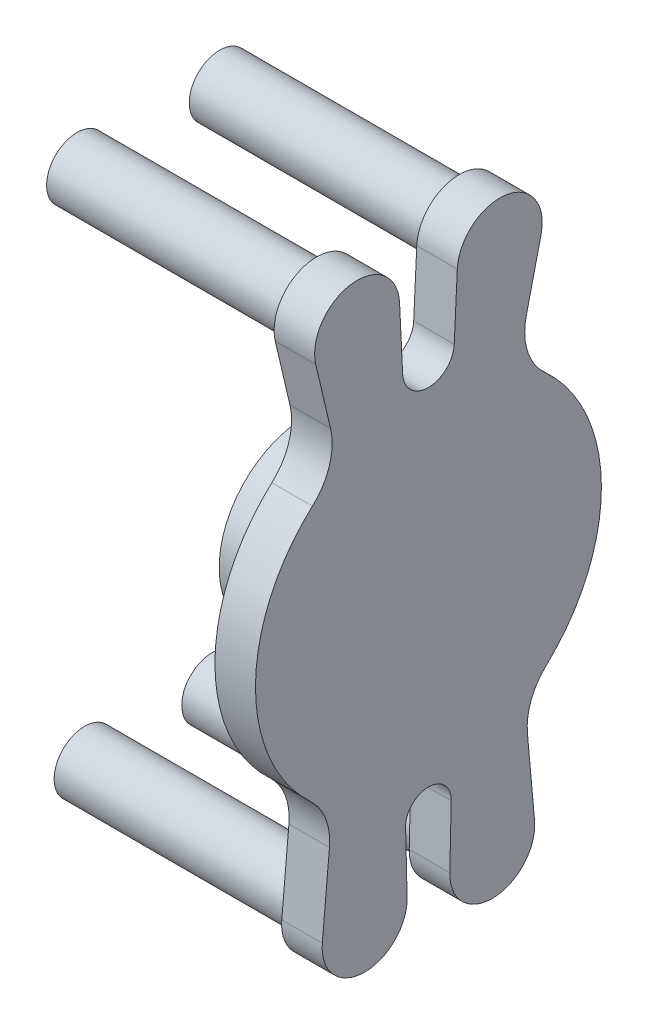
ISO-10303-21;
HEADER;
FILE_DESCRIPTION(('STEP AP214'),'2;1');
FILE_NAME('part.step','',(''),(''),'','','');
FILE_SCHEMA(('AUTOMOTIVE_DESIGN { 1 0 10303 214 1 1 1 1 }'));
ENDSEC;
DATA;
#1=APPLICATION_CONTEXT('core data for automotive mechanical design processes');
#2=APPLICATION_PROTOCOL_DEFINITION('international standard','automotive_design',2000,#1);
#3=PRODUCT_CONTEXT('',#1,'mechanical');
#4=PRODUCT('Part','Part','',(#3));
#5=PRODUCT_RELATED_PRODUCT_CATEGORY('part','',(#4));
#6=PRODUCT_DEFINITION_FORMATION('','',#4);
#7=PRODUCT_DEFINITION_CONTEXT('part definition',#1,'design');
#8=PRODUCT_DEFINITION('design','',#6,#7);
#9=PRODUCT_DEFINITION_SHAPE('','',#8);
#10=(LENGTH_UNIT() NAMED_UNIT(*) SI_UNIT(.MILLI.,.METRE.));
#11=(NAMED_UNIT(*) PLANE_ANGLE_UNIT() SI_UNIT($,.RADIAN.));
#12=(NAMED_UNIT(*) SI_UNIT($,.STERADIAN.) SOLID_ANGLE_UNIT());
#13=UNCERTAINTY_MEASURE_WITH_UNIT(LENGTH_MEASURE(1.E-05),#10,'distance_accuracy_value','');
#14=(GEOMETRIC_REPRESENTATION_CONTEXT(3) GLOBAL_UNCERTAINTY_ASSIGNED_CONTEXT((#13)) GLOBAL_UNIT_ASSIGNED_CONTEXT((#10,
#11,#12)) REPRESENTATION_CONTEXT('',''));
#15=CARTESIAN_POINT('',(0.,0.,0.));
#16=DIRECTION('',(0.,0.,1.));
#17=DIRECTION('',(1.,0.,0.));
#18=AXIS2_PLACEMENT_3D('',#15,#16,#17);
#19=CARTESIAN_POINT('',(8.25500000000001,0.,0.));
#20=DIRECTION('',(1.,0.,0.));
#21=DIRECTION('',(0.,1.,0.));
#22=AXIS2_PLACEMENT_3D('',#19,#20,#21);
#23=PLANE('',#22);
#24=CARTESIAN_POINT('',(8.25500000000001,0.,0.));
#25=DIRECTION('',(-1.,0.,0.));
#26=DIRECTION('',(0.,-1.,0.));
#27=AXIS2_PLACEMENT_3D('',#24,#25,#26);
#28=CIRCLE('',#27,3.71475);
#29=CARTESIAN_POINT('',(8.25500000000001,-3.71474999999999,0.));
#30=VERTEX_POINT('',#29);
#31=EDGE_CURVE('E300',#30,#30,#28,.T.);
#32=ORIENTED_EDGE('',*,*,#31,.F.);
#33=EDGE_LOOP('',(#32));
#34=FACE_BOUND('',#33,.T.);
#35=CARTESIAN_POINT('',(8.25500000000001,0.,0.));
#36=DIRECTION('',(-1.,0.,0.));
#37=DIRECTION('',(0.,-1.,0.));
#38=AXIS2_PLACEMENT_3D('',#35,#36,#37);
#39=CIRCLE('',#38,18.542);
#40=CARTESIAN_POINT('',(8.25500000000002,-18.542,0.));
#41=VERTEX_POINT('',#40);
#42=EDGE_CURVE('E299',#41,#41,#39,.T.);
#43=ORIENTED_EDGE('',*,*,#42,.T.);
#44=EDGE_LOOP('',(#43));
#45=FACE_BOUND('',#44,.T.);
#46=ADVANCED_FACE('F36',(#34,#45),#23,.F.);
#47=CARTESIAN_POINT('',(8.255,0.,0.));
#48=DIRECTION('',(-1.,0.,0.));
#49=DIRECTION('',(0.,-1.,0.));
#50=AXIS2_PLACEMENT_3D('',#47,#48,#49);
#51=CYLINDRICAL_SURFACE('',#50,18.542);
#52=ORIENTED_EDGE('',*,*,#42,.F.);
#53=EDGE_LOOP('',(#52));
#54=FACE_BOUND('',#53,.T.);
#55=CARTESIAN_POINT('',(25.4,0.,0.));
#56=DIRECTION('',(-1.,0.,0.));
#57=DIRECTION('',(0.,-1.,0.));
#58=AXIS2_PLACEMENT_3D('',#55,#56,#57);
#59=CIRCLE('',#58,18.542);
#60=CARTESIAN_POINT('',(25.4,-18.542,0.));
#61=VERTEX_POINT('',#60);
#62=EDGE_CURVE('E295',#61,#61,#59,.T.);
#63=ORIENTED_EDGE('',*,*,#62,.T.);
#64=EDGE_LOOP('',(#63));
#65=FACE_BOUND('',#64,.T.);
#66=ADVANCED_FACE('F347',(#54,#65),#51,.T.);
#67=CARTESIAN_POINT('',(16.8275,0.,0.));
#68=DIRECTION('',(-1.,0.,0.));
#69=DIRECTION('',(0.,-1.,0.));
#70=AXIS2_PLACEMENT_3D('',#67,#68,#69);
#71=CYLINDRICAL_SURFACE('',#70,3.71475);
#72=CARTESIAN_POINT('',(16.8275,0.,0.));
#73=DIRECTION('',(-1.,0.,0.));
#74=DIRECTION('',(0.,-1.,0.));
#75=AXIS2_PLACEMENT_3D('',#72,#73,#74);
#76=CIRCLE('',#75,3.71475);
#77=CARTESIAN_POINT('',(16.8275,-3.71474999999999,0.));
#78=VERTEX_POINT('',#77);
#79=EDGE_CURVE('E296',#78,#78,#76,.T.);
#80=ORIENTED_EDGE('',*,*,#79,.F.);
#81=EDGE_LOOP('',(#80));
#82=FACE_BOUND('',#81,.T.);
#83=ORIENTED_EDGE('',*,*,#31,.T.);
#84=EDGE_LOOP('',(#83));
#85=FACE_BOUND('',#84,.T.);
#86=ADVANCED_FACE('F352',(#82,#85),#71,.F.);
#87=CARTESIAN_POINT('',(16.8275,0.,0.));
#88=DIRECTION('',(-1.,0.,0.));
#89=DIRECTION('',(0.,-1.,0.));
#90=AXIS2_PLACEMENT_3D('',#87,#88,#89);
#91=PLANE('',#90);
#92=ORIENTED_EDGE('',*,*,#79,.T.);
#93=EDGE_LOOP('',(#92));
#94=FACE_BOUND('',#93,.T.);
#95=ADVANCED_FACE('F360',(#94),#91,.T.);
#96=CARTESIAN_POINT('',(33.9725,0.,0.));
#97=DIRECTION('',(-1.,0.,0.));
#98=DIRECTION('',(0.,-1.,0.));
#99=AXIS2_PLACEMENT_3D('',#96,#97,#98);
#100=CYLINDRICAL_SURFACE('',#99,36.576);
#101=CARTESIAN_POINT('',(25.4,0.,0.));
#102=DIRECTION('',(1.,0.,0.));
#103=DIRECTION('',(0.,1.,0.));
#104=AXIS2_PLACEMENT_3D('',#101,#102,#103);
#105=CIRCLE('',#104,36.576);
#106=CARTESIAN_POINT('',(25.4,27.1193867572378,24.5426697388722));
#107=VERTEX_POINT('',#106);
#108=CARTESIAN_POINT('',(25.4,-26.766566092711,24.9269876961605));
#109=VERTEX_POINT('',#108);
#110=EDGE_CURVE('E205',#107,#109,#105,.T.);
#111=ORIENTED_EDGE('',*,*,#110,.T.);
#112=DIRECTION('',(-1.,0.,0.));
#113=VECTOR('',#112,1.);
#114=CARTESIAN_POINT('',(33.9725,-26.766566092711,24.9269876961605));
#115=LINE('',#114,#113);
#116=CARTESIAN_POINT('',(33.9725,-26.766566092711,24.9269876961605));
#117=VERTEX_POINT('',#116);
#118=EDGE_CURVE('E293',#117,#109,#115,.T.);
#119=ORIENTED_EDGE('',*,*,#118,.F.);
#120=CARTESIAN_POINT('',(33.9725,0.,0.));
#121=DIRECTION('',(1.,0.,0.));
#122=DIRECTION('',(0.,1.,0.));
#123=AXIS2_PLACEMENT_3D('',#120,#121,#122);
#124=CIRCLE('',#123,36.576);
#125=CARTESIAN_POINT('',(33.9725,27.1193867572378,24.5426697388722));
#126=VERTEX_POINT('',#125);
#127=EDGE_CURVE('E244',#126,#117,#124,.T.);
#128=ORIENTED_EDGE('',*,*,#127,.F.);
#129=DIRECTION('',(-1.,0.,0.));
#130=VECTOR('',#129,1.);
#131=CARTESIAN_POINT('',(33.9725,27.1193867572378,24.5426697388722));
#132=LINE('',#131,#130);
#133=EDGE_CURVE('E201',#126,#107,#132,.T.);
#134=ORIENTED_EDGE('',*,*,#133,.T.);
#135=EDGE_LOOP('',(#111,#119,#128,#134));
#136=FACE_BOUND('',#135,.T.);
#137=ADVANCED_FACE('F335',(#136),#100,.T.);
#138=CARTESIAN_POINT('',(33.9725,-36.06051265268,33.5821917573273));
#139=DIRECTION('',(-1.,0.,0.));
#140=DIRECTION('',(0.,-1.,0.));
#141=AXIS2_PLACEMENT_3D('',#138,#139,#140);
#142=CYLINDRICAL_SURFACE('',#141,12.7);
#143=CARTESIAN_POINT('',(25.4,-36.06051265268,33.5821917573273));
#144=DIRECTION('',(-1.,0.,0.));
#145=DIRECTION('',(0.,-1.,0.));
#146=AXIS2_PLACEMENT_3D('',#143,#144,#145);
#147=CIRCLE('',#146,12.7);
#148=CARTESIAN_POINT('',(25.4,-37.199446596565,20.9333645598569));
#149=VERTEX_POINT('',#148);
#150=EDGE_CURVE('E208',#109,#149,#147,.T.);
#151=ORIENTED_EDGE('',*,*,#150,.T.);
#152=DIRECTION('',(-1.,0.,0.));
#153=VECTOR('',#152,1.);
#154=CARTESIAN_POINT('',(33.9725,-37.199446596565,20.9333645598569));
#155=LINE('',#154,#153);
#156=CARTESIAN_POINT('',(33.9725,-37.199446596565,20.9333645598569));
#157=VERTEX_POINT('',#156);
#158=EDGE_CURVE('E290',#157,#149,#155,.T.);
#159=ORIENTED_EDGE('',*,*,#158,.F.);
#160=CARTESIAN_POINT('',(33.9725,-36.06051265268,33.5821917573273));
#161=DIRECTION('',(-1.,0.,0.));
#162=DIRECTION('',(0.,-1.,0.));
#163=AXIS2_PLACEMENT_3D('',#160,#161,#162);
#164=CIRCLE('',#163,12.7);
#165=EDGE_CURVE('E132',#117,#157,#164,.T.);
#166=ORIENTED_EDGE('',*,*,#165,.F.);
#167=ORIENTED_EDGE('',*,*,#118,.T.);
#168=EDGE_LOOP('',(#151,#159,#166,#167));
#169=FACE_BOUND('',#168,.T.);
#170=ADVANCED_FACE('F372',(#169),#142,.F.);
#171=CARTESIAN_POINT('',(33.9725,-37.199446596565,20.9333645598569));
#172=DIRECTION('',(0.,-0.0896798381011747,-0.99597064547011));
#173=DIRECTION('',(0.,0.99597064547011,-0.0896798381011748));
#174=AXIS2_PLACEMENT_3D('',#171,#172,#173);
#175=PLANE('',#174);
#176=DIRECTION('',(0.,-0.99597064547011,0.0896798381011748));
#177=VECTOR('',#176,1.);
#178=CARTESIAN_POINT('',(25.4,-37.199446596565,20.9333645598569));
#179=LINE('',#178,#177);
#180=CARTESIAN_POINT('',(25.4,-53.9629542347014,22.4427952422103));
#181=VERTEX_POINT('',#180);
#182=EDGE_CURVE('E211',#149,#181,#179,.T.);
#183=ORIENTED_EDGE('',*,*,#182,.T.);
#184=DIRECTION('',(-1.,0.,0.));
#185=VECTOR('',#184,1.);
#186=CARTESIAN_POINT('',(33.9725,-53.9629542347014,22.4427952422103));
#187=LINE('',#186,#185);
#188=CARTESIAN_POINT('',(33.9725,-53.9629542347014,22.4427952422103));
#189=VERTEX_POINT('',#188);
#190=EDGE_CURVE('E287',#189,#181,#187,.T.);
#191=ORIENTED_EDGE('',*,*,#190,.F.);
#192=DIRECTION('',(0.,-0.99597064547011,0.0896798381011748));
#193=VECTOR('',#192,1.);
#194=CARTESIAN_POINT('',(33.9725,-37.199446596565,20.9333645598569));
#195=LINE('',#194,#193);
#196=EDGE_CURVE('E656',#157,#189,#195,.T.);
#197=ORIENTED_EDGE('',*,*,#196,.F.);
#198=ORIENTED_EDGE('',*,*,#158,.T.);
#199=EDGE_LOOP('',(#183,#191,#197,#198));
#200=FACE_BOUND('',#199,.T.);
#201=ADVANCED_FACE('F375',(#200),#175,.F.);
#202=CARTESIAN_POINT('',(33.9725,-54.76875,13.49375));
#203=DIRECTION('',(-1.,0.,0.));
#204=DIRECTION('',(0.,-1.,0.));
#205=AXIS2_PLACEMENT_3D('',#202,#203,#204);
#206=CYLINDRICAL_SURFACE('',#205,8.98524999999999);
#207=CARTESIAN_POINT('',(25.4,-54.76875,13.49375));
#208=DIRECTION('',(1.,0.,0.));
#209=DIRECTION('',(0.,1.,0.));
#210=AXIS2_PLACEMENT_3D('',#207,#208,#209);
#211=CIRCLE('',#210,8.98524999999999);
#212=CARTESIAN_POINT('',(25.4,-54.5527011469293,4.51109780504184));
#213=VERTEX_POINT('',#212);
#214=EDGE_CURVE('E213',#181,#213,#211,.T.);
#215=ORIENTED_EDGE('',*,*,#214,.T.);
#216=DIRECTION('',(-1.,0.,0.));
#217=VECTOR('',#216,1.);
#218=CARTESIAN_POINT('',(33.9725,-54.5527011469293,4.51109780504184));
#219=LINE('',#218,#217);
#220=CARTESIAN_POINT('',(33.9725,-54.5527011469293,4.51109780504184));
#221=VERTEX_POINT('',#220);
#222=EDGE_CURVE('E284',#221,#213,#219,.T.);
#223=ORIENTED_EDGE('',*,*,#222,.F.);
#224=CARTESIAN_POINT('',(33.9725,-54.76875,13.49375));
#225=DIRECTION('',(1.,0.,0.));
#226=DIRECTION('',(0.,1.,0.));
#227=AXIS2_PLACEMENT_3D('',#224,#225,#226);
#228=CIRCLE('',#227,8.98524999999999);
#229=EDGE_CURVE('E658',#189,#221,#228,.T.);
#230=ORIENTED_EDGE('',*,*,#229,.F.);
#231=ORIENTED_EDGE('',*,*,#190,.T.);
#232=EDGE_LOOP('',(#215,#223,#230,#231));
#233=FACE_BOUND('',#232,.T.);
#234=ADVANCED_FACE('F378',(#233),#206,.T.);
#235=CARTESIAN_POINT('',(33.9725,-54.5527011469293,4.51109780504184));
#236=DIRECTION('',(0.,-0.0240448349317749,0.999710881161701));
#237=DIRECTION('',(0.,-0.999710881161701,-0.0240448349317749));
#238=AXIS2_PLACEMENT_3D('',#235,#236,#237);
#239=PLANE('',#238);
#240=DIRECTION('',(0.,0.999710881161701,0.0240448349317749));
#241=VECTOR('',#240,1.);
#242=CARTESIAN_POINT('',(25.4,-54.5527011469293,4.51109780504184));
#243=LINE('',#242,#241);
#244=CARTESIAN_POINT('',(25.4,-41.5180403733808,4.82460471248639));
#245=VERTEX_POINT('',#244);
#246=EDGE_CURVE('E215',#213,#245,#243,.T.);
#247=ORIENTED_EDGE('',*,*,#246,.T.);
#248=DIRECTION('',(-1.,0.,0.));
#249=VECTOR('',#248,1.);
#250=CARTESIAN_POINT('',(33.9725,-41.5180403733807,4.82460471248639));
#251=LINE('',#250,#249);
#252=CARTESIAN_POINT('',(33.9725,-41.5180403733807,4.82460471248639));
#253=VERTEX_POINT('',#252);
#254=EDGE_CURVE('E281',#253,#245,#251,.T.);
#255=ORIENTED_EDGE('',*,*,#254,.F.);
#256=DIRECTION('',(0.,0.999710881161701,0.0240448349317749));
#257=VECTOR('',#256,1.);
#258=CARTESIAN_POINT('',(33.9725,-54.5527011469293,4.51109780504184));
#259=LINE('',#258,#257);
#260=EDGE_CURVE('E660',#221,#253,#259,.T.);
#261=ORIENTED_EDGE('',*,*,#260,.F.);
#262=ORIENTED_EDGE('',*,*,#222,.T.);
#263=EDGE_LOOP('',(#247,#255,#261,#262));
#264=FACE_BOUND('',#263,.T.);
#265=ADVANCED_FACE('F382',(#264),#239,.F.);
#266=CARTESIAN_POINT('',(33.9725,-41.402,0.));
#267=DIRECTION('',(-1.,0.,0.));
#268=DIRECTION('',(0.,-1.,0.));
#269=AXIS2_PLACEMENT_3D('',#266,#267,#268);
#270=CYLINDRICAL_SURFACE('',#269,4.82600000000001);
#271=CARTESIAN_POINT('',(25.4,-41.402,0.));
#272=DIRECTION('',(-1.,0.,0.));
#273=DIRECTION('',(0.,-1.,0.));
#274=AXIS2_PLACEMENT_3D('',#271,#272,#273);
#275=CIRCLE('',#274,4.82600000000001);
#276=CARTESIAN_POINT('',(25.4,-41.5180403733808,-4.82460471248639));
#277=VERTEX_POINT('',#276);
#278=EDGE_CURVE('E217',#245,#277,#275,.T.);
#279=ORIENTED_EDGE('',*,*,#278,.T.);
#280=DIRECTION('',(-1.,0.,0.));
#281=VECTOR('',#280,1.);
#282=CARTESIAN_POINT('',(33.9725,-41.5180403733807,-4.82460471248639));
#283=LINE('',#282,#281);
#284=CARTESIAN_POINT('',(33.9725,-41.5180403733807,-4.82460471248639));
#285=VERTEX_POINT('',#284);
#286=EDGE_CURVE('E278',#285,#277,#283,.T.);
#287=ORIENTED_EDGE('',*,*,#286,.F.);
#288=CARTESIAN_POINT('',(33.9725,-41.402,0.));
#289=DIRECTION('',(-1.,0.,0.));
#290=DIRECTION('',(0.,-1.,0.));
#291=AXIS2_PLACEMENT_3D('',#288,#289,#290);
#292=CIRCLE('',#291,4.82600000000001);
#293=EDGE_CURVE('E662',#253,#285,#292,.T.);
#294=ORIENTED_EDGE('',*,*,#293,.F.);
#295=ORIENTED_EDGE('',*,*,#254,.T.);
#296=EDGE_LOOP('',(#279,#287,#294,#295));
#297=FACE_BOUND('',#296,.T.);
#298=ADVANCED_FACE('F386',(#297),#270,.F.);
#299=CARTESIAN_POINT('',(33.9725,-54.5527011469293,-4.51109780504187));
#300=DIRECTION('',(0.,-0.0240448349317741,-0.999710881161701));
#301=DIRECTION('',(0.,0.999710881161701,-0.0240448349317741));
#302=AXIS2_PLACEMENT_3D('',#299,#300,#301);
#303=PLANE('',#302);
#304=DIRECTION('',(0.,-0.999710881161701,0.0240448349317741));
#305=VECTOR('',#304,1.);
#306=CARTESIAN_POINT('',(25.4,-54.5527011469293,-4.51109780504187));
#307=LINE('',#306,#305);
#308=CARTESIAN_POINT('',(25.4,-54.5527011469293,-4.51109780504184));
#309=VERTEX_POINT('',#308);
#310=EDGE_CURVE('E219',#277,#309,#307,.T.);
#311=ORIENTED_EDGE('',*,*,#310,.T.);
#312=DIRECTION('',(-1.,0.,0.));
#313=VECTOR('',#312,1.);
#314=CARTESIAN_POINT('',(33.9725,-54.5527011469293,-4.51109780504184));
#315=LINE('',#314,#313);
#316=CARTESIAN_POINT('',(33.9725,-54.5527011469293,-4.51109780504184));
#317=VERTEX_POINT('',#316);
#318=EDGE_CURVE('E275',#317,#309,#315,.T.);
#319=ORIENTED_EDGE('',*,*,#318,.F.);
#320=DIRECTION('',(0.,-0.999710881161701,0.0240448349317741));
#321=VECTOR('',#320,1.);
#322=CARTESIAN_POINT('',(33.9725,-54.5527011469293,-4.51109780504187));
#323=LINE('',#322,#321);
#324=EDGE_CURVE('E664',#285,#317,#323,.T.);
#325=ORIENTED_EDGE('',*,*,#324,.F.);
#326=ORIENTED_EDGE('',*,*,#286,.T.);
#327=EDGE_LOOP('',(#311,#319,#325,#326));
#328=FACE_BOUND('',#327,.T.);
#329=ADVANCED_FACE('F390',(#328),#303,.F.);
#330=CARTESIAN_POINT('',(33.9725,-54.76875,-13.49375));
#331=DIRECTION('',(-1.,0.,0.));
#332=DIRECTION('',(0.,-1.,0.));
#333=AXIS2_PLACEMENT_3D('',#330,#331,#332);
#334=CYLINDRICAL_SURFACE('',#333,8.98524999999999);
#335=CARTESIAN_POINT('',(25.4,-54.76875,-13.49375));
#336=DIRECTION('',(1.,0.,0.));
#337=DIRECTION('',(0.,1.,0.));
#338=AXIS2_PLACEMENT_3D('',#335,#336,#337);
#339=CIRCLE('',#338,8.98524999999999);
#340=CARTESIAN_POINT('',(25.4,-53.9629542347014,-22.4427952422103));
#341=VERTEX_POINT('',#340);
#342=EDGE_CURVE('E221',#309,#341,#339,.T.);
#343=ORIENTED_EDGE('',*,*,#342,.T.);
#344=DIRECTION('',(-1.,0.,0.));
#345=VECTOR('',#344,1.);
#346=CARTESIAN_POINT('',(33.9725,-53.9629542347014,-22.4427952422103));
#347=LINE('',#346,#345);
#348=CARTESIAN_POINT('',(33.9725,-53.9629542347014,-22.4427952422103));
#349=VERTEX_POINT('',#348);
#350=EDGE_CURVE('E272',#349,#341,#347,.T.);
#351=ORIENTED_EDGE('',*,*,#350,.F.);
#352=CARTESIAN_POINT('',(33.9725,-54.76875,-13.49375));
#353=DIRECTION('',(1.,0.,0.));
#354=DIRECTION('',(0.,1.,0.));
#355=AXIS2_PLACEMENT_3D('',#352,#353,#354);
#356=CIRCLE('',#355,8.98524999999999);
#357=EDGE_CURVE('E666',#317,#349,#356,.T.);
#358=ORIENTED_EDGE('',*,*,#357,.F.);
#359=ORIENTED_EDGE('',*,*,#318,.T.);
#360=EDGE_LOOP('',(#343,#351,#358,#359));
#361=FACE_BOUND('',#360,.T.);
#362=ADVANCED_FACE('F394',(#361),#334,.T.);
#363=CARTESIAN_POINT('',(33.9725,-37.1994465965649,-20.9333645598569));
#364=DIRECTION('',(0.,-0.0896798381011756,0.99597064547011));
#365=DIRECTION('',(0.,-0.99597064547011,-0.0896798381011756));
#366=AXIS2_PLACEMENT_3D('',#363,#364,#365);
#367=PLANE('',#366);
#368=DIRECTION('',(0.,0.99597064547011,0.0896798381011756));
#369=VECTOR('',#368,1.);
#370=CARTESIAN_POINT('',(25.4,-37.1994465965649,-20.9333645598569));
#371=LINE('',#370,#369);
#372=CARTESIAN_POINT('',(25.4,-37.1994465965649,-20.9333645598569));
#373=VERTEX_POINT('',#372);
#374=EDGE_CURVE('E223',#341,#373,#371,.T.);
#375=ORIENTED_EDGE('',*,*,#374,.T.);
#376=DIRECTION('',(-1.,0.,0.));
#377=VECTOR('',#376,1.);
#378=CARTESIAN_POINT('',(33.9725,-37.1994465965649,-20.9333645598569));
#379=LINE('',#378,#377);
#380=CARTESIAN_POINT('',(33.9725,-37.1994465965649,-20.9333645598569));
#381=VERTEX_POINT('',#380);
#382=EDGE_CURVE('E269',#381,#373,#379,.T.);
#383=ORIENTED_EDGE('',*,*,#382,.F.);
#384=DIRECTION('',(0.,0.99597064547011,0.0896798381011756));
#385=VECTOR('',#384,1.);
#386=CARTESIAN_POINT('',(33.9725,-37.1994465965649,-20.9333645598569));
#387=LINE('',#386,#385);
#388=EDGE_CURVE('E668',#349,#381,#387,.T.);
#389=ORIENTED_EDGE('',*,*,#388,.F.);
#390=ORIENTED_EDGE('',*,*,#350,.T.);
#391=EDGE_LOOP('',(#375,#383,#389,#390));
#392=FACE_BOUND('',#391,.T.);
#393=ADVANCED_FACE('F398',(#392),#367,.F.);
#394=CARTESIAN_POINT('',(33.9725,-36.06051265268,-33.5821917573273));
#395=DIRECTION('',(-1.,0.,0.));
#396=DIRECTION('',(0.,-1.,0.));
#397=AXIS2_PLACEMENT_3D('',#394,#395,#396);
#398=CYLINDRICAL_SURFACE('',#397,12.7);
#399=CARTESIAN_POINT('',(25.4,-36.06051265268,-33.5821917573273));
#400=DIRECTION('',(-1.,0.,0.));
#401=DIRECTION('',(0.,1.,0.));
#402=AXIS2_PLACEMENT_3D('',#399,#400,#401);
#403=CIRCLE('',#402,12.7);
#404=CARTESIAN_POINT('',(25.4,-26.766566092711,-24.9269876961605));
#405=VERTEX_POINT('',#404);
#406=EDGE_CURVE('E225',#373,#405,#403,.T.);
#407=ORIENTED_EDGE('',*,*,#406,.T.);
#408=DIRECTION('',(-1.,0.,0.));
#409=VECTOR('',#408,1.);
#410=CARTESIAN_POINT('',(33.9725,-26.7665660927109,-24.9269876961605));
#411=LINE('',#410,#409);
#412=CARTESIAN_POINT('',(33.9725,-26.7665660927109,-24.9269876961605));
#413=VERTEX_POINT('',#412);
#414=EDGE_CURVE('E266',#413,#405,#411,.T.);
#415=ORIENTED_EDGE('',*,*,#414,.F.);
#416=CARTESIAN_POINT('',(33.9725,-36.06051265268,-33.5821917573273));
#417=DIRECTION('',(-1.,0.,0.));
#418=DIRECTION('',(0.,1.,0.));
#419=AXIS2_PLACEMENT_3D('',#416,#417,#418);
#420=CIRCLE('',#419,12.7);
#421=EDGE_CURVE('E670',#381,#413,#420,.T.);
#422=ORIENTED_EDGE('',*,*,#421,.F.);
#423=ORIENTED_EDGE('',*,*,#382,.T.);
#424=EDGE_LOOP('',(#407,#415,#422,#423));
#425=FACE_BOUND('',#424,.T.);
#426=ADVANCED_FACE('F402',(#425),#398,.F.);
#427=CARTESIAN_POINT('',(33.9725,0.,0.));
#428=DIRECTION('',(-1.,0.,0.));
#429=DIRECTION('',(0.,-1.,0.));
#430=AXIS2_PLACEMENT_3D('',#427,#428,#429);
#431=CYLINDRICAL_SURFACE('',#430,36.576);
#432=CARTESIAN_POINT('',(25.4,0.,0.));
#433=DIRECTION('',(1.,0.,0.));
#434=DIRECTION('',(0.,1.,0.));
#435=AXIS2_PLACEMENT_3D('',#432,#433,#434);
#436=CIRCLE('',#435,36.576);
#437=CARTESIAN_POINT('',(25.4,27.1193867572378,-24.5426697388722));
#438=VERTEX_POINT('',#437);
#439=EDGE_CURVE('E227',#405,#438,#436,.T.);
#440=ORIENTED_EDGE('',*,*,#439,.T.);
#441=DIRECTION('',(-1.,0.,0.));
#442=VECTOR('',#441,1.);
#443=CARTESIAN_POINT('',(33.9725,27.1193867572378,-24.5426697388722));
#444=LINE('',#443,#442);
#445=CARTESIAN_POINT('',(33.9725,27.1193867572378,-24.5426697388722));
#446=VERTEX_POINT('',#445);
#447=EDGE_CURVE('E263',#446,#438,#444,.T.);
#448=ORIENTED_EDGE('',*,*,#447,.F.);
#449=CARTESIAN_POINT('',(33.9725,0.,0.));
#450=DIRECTION('',(1.,0.,0.));
#451=DIRECTION('',(0.,1.,0.));
#452=AXIS2_PLACEMENT_3D('',#449,#450,#451);
#453=CIRCLE('',#452,36.576);
#454=EDGE_CURVE('E672',#413,#446,#453,.T.);
#455=ORIENTED_EDGE('',*,*,#454,.F.);
#456=ORIENTED_EDGE('',*,*,#414,.T.);
#457=EDGE_LOOP('',(#440,#448,#455,#456));
#458=FACE_BOUND('',#457,.T.);
#459=ADVANCED_FACE('F406',(#458),#431,.T.);
#460=CARTESIAN_POINT('',(33.9725,36.5358404923898,-33.0644300648696));
#461=DIRECTION('',(-1.,0.,0.));
#462=DIRECTION('',(0.,-1.,0.));
#463=AXIS2_PLACEMENT_3D('',#460,#461,#462);
#464=CYLINDRICAL_SURFACE('',#463,12.7);
#465=CARTESIAN_POINT('',(25.4,36.5358404923898,-33.0644300648696));
#466=DIRECTION('',(-1.,0.,0.));
#467=DIRECTION('',(0.,-1.,0.));
#468=AXIS2_PLACEMENT_3D('',#465,#466,#467);
#469=CIRCLE('',#468,12.7);
#470=CARTESIAN_POINT('',(25.4,39.4483236675717,-20.7028993443527));
#471=VERTEX_POINT('',#470);
#472=EDGE_CURVE('E229',#438,#471,#469,.T.);
#473=ORIENTED_EDGE('',*,*,#472,.T.);
#474=DIRECTION('',(-1.,0.,0.));
#475=VECTOR('',#474,1.);
#476=CARTESIAN_POINT('',(33.9725,39.4483236675717,-20.7028993443527));
#477=LINE('',#476,#475);
#478=CARTESIAN_POINT('',(33.9725,39.4483236675717,-20.7028993443527));
#479=VERTEX_POINT('',#478);
#480=EDGE_CURVE('E260',#479,#471,#477,.T.);
#481=ORIENTED_EDGE('',*,*,#480,.F.);
#482=CARTESIAN_POINT('',(33.9725,36.5358404923898,-33.0644300648696));
#483=DIRECTION('',(-1.,0.,0.));
#484=DIRECTION('',(0.,-1.,0.));
#485=AXIS2_PLACEMENT_3D('',#482,#483,#484);
#486=CIRCLE('',#485,12.7);
#487=EDGE_CURVE('E674',#446,#479,#486,.T.);
#488=ORIENTED_EDGE('',*,*,#487,.F.);
#489=ORIENTED_EDGE('',*,*,#447,.T.);
#490=EDGE_LOOP('',(#473,#481,#488,#489));
#491=FACE_BOUND('',#490,.T.);
#492=ADVANCED_FACE('F410',(#491),#464,.F.);
#493=CARTESIAN_POINT('',(33.9725,39.4483236675717,-20.7028993443527));
#494=DIRECTION('',(0.,0.229329383872591,0.97334887563125));
#495=DIRECTION('',(0.,-0.97334887563125,0.229329383872591));
#496=AXIS2_PLACEMENT_3D('',#493,#494,#495);
#497=PLANE('',#496);
#498=DIRECTION('',(0.,0.97334887563125,-0.229329383872591));
#499=VECTOR('',#498,1.);
#500=CARTESIAN_POINT('',(25.4,39.4483236675717,-20.7028993443527));
#501=LINE('',#500,#499);
#502=CARTESIAN_POINT('',(25.4,52.7081681535588,-23.8270329847657));
#503=VERTEX_POINT('',#502);
#504=EDGE_CURVE('E231',#471,#503,#501,.T.);
#505=ORIENTED_EDGE('',*,*,#504,.T.);
#506=DIRECTION('',(-1.,0.,0.));
#507=VECTOR('',#506,1.);
#508=CARTESIAN_POINT('',(33.9725,52.7081681535588,-23.8270329847657));
#509=LINE('',#508,#507);
#510=CARTESIAN_POINT('',(33.9725,52.7081681535588,-23.8270329847657));
#511=VERTEX_POINT('',#510);
#512=EDGE_CURVE('E257',#511,#503,#509,.T.);
#513=ORIENTED_EDGE('',*,*,#512,.F.);
#514=DIRECTION('',(0.,0.97334887563125,-0.229329383872591));
#515=VECTOR('',#514,1.);
#516=CARTESIAN_POINT('',(33.9725,39.4483236675717,-20.7028993443527));
#517=LINE('',#516,#515);
#518=EDGE_CURVE('E676',#479,#511,#517,.T.);
#519=ORIENTED_EDGE('',*,*,#518,.F.);
#520=ORIENTED_EDGE('',*,*,#480,.T.);
#521=EDGE_LOOP('',(#505,#513,#519,#520));
#522=FACE_BOUND('',#521,.T.);
#523=ADVANCED_FACE('F414',(#522),#497,.F.);
#524=CARTESIAN_POINT('',(33.9725,54.76875,-15.08125));
#525=DIRECTION('',(-1.,0.,0.));
#526=DIRECTION('',(0.,-1.,0.));
#527=AXIS2_PLACEMENT_3D('',#524,#525,#526);
#528=CYLINDRICAL_SURFACE('',#527,8.98525);
#529=CARTESIAN_POINT('',(25.4,54.76875,-15.08125));
#530=DIRECTION('',(1.,0.,0.));
#531=DIRECTION('',(0.,1.,0.));
#532=AXIS2_PLACEMENT_3D('',#529,#530,#531);
#533=CIRCLE('',#532,8.98525);
#534=CARTESIAN_POINT('',(25.4,55.2051921211717,-6.10660594926648));
#535=VERTEX_POINT('',#534);
#536=EDGE_CURVE('E233',#503,#535,#533,.T.);
#537=ORIENTED_EDGE('',*,*,#536,.T.);
#538=DIRECTION('',(-1.,0.,0.));
#539=VECTOR('',#538,1.);
#540=CARTESIAN_POINT('',(33.9725,55.2051921211717,-6.10660594926648));
#541=LINE('',#540,#539);
#542=CARTESIAN_POINT('',(33.9725,55.2051921211717,-6.10660594926648));
#543=VERTEX_POINT('',#542);
#544=EDGE_CURVE('E254',#543,#535,#541,.T.);
#545=ORIENTED_EDGE('',*,*,#544,.F.);
#546=CARTESIAN_POINT('',(33.9725,54.76875,-15.08125));
#547=DIRECTION('',(1.,0.,0.));
#548=DIRECTION('',(0.,1.,0.));
#549=AXIS2_PLACEMENT_3D('',#546,#547,#548);
#550=CIRCLE('',#549,8.98525);
#551=EDGE_CURVE('E678',#511,#543,#550,.T.);
#552=ORIENTED_EDGE('',*,*,#551,.F.);
#553=ORIENTED_EDGE('',*,*,#512,.T.);
#554=EDGE_LOOP('',(#537,#545,#552,#553));
#555=FACE_BOUND('',#554,.T.);
#556=ADVANCED_FACE('F418',(#555),#528,.T.);
#557=CARTESIAN_POINT('',(33.9725,55.2051921211717,-6.10660594926648));
#558=DIRECTION('',(0.,-0.0485731750559753,-0.998819626691918));
#559=DIRECTION('',(0.,0.998819626691918,-0.0485731750559753));
#560=AXIS2_PLACEMENT_3D('',#557,#558,#559);
#561=PLANE('',#560);
#562=DIRECTION('',(0.,-0.998819626691917,0.0485731750559753));
#563=VECTOR('',#562,1.);
#564=CARTESIAN_POINT('',(25.4,55.2051921211717,-6.10660594926648));
#565=LINE('',#564,#563);
#566=CARTESIAN_POINT('',(25.4,41.7705188645479,-5.45327003307596));
#567=VERTEX_POINT('',#566);
#568=EDGE_CURVE('E235',#535,#567,#565,.T.);
#569=ORIENTED_EDGE('',*,*,#568,.T.);
#570=DIRECTION('',(-1.,0.,0.));
#571=VECTOR('',#570,1.);
#572=CARTESIAN_POINT('',(33.9725,41.7705188645479,-5.45327003307596));
#573=LINE('',#572,#571);
#574=CARTESIAN_POINT('',(33.9725,41.7705188645479,-5.45327003307596));
#575=VERTEX_POINT('',#574);
#576=EDGE_CURVE('E251',#575,#567,#573,.T.);
#577=ORIENTED_EDGE('',*,*,#576,.F.);
#578=DIRECTION('',(0.,-0.998819626691917,0.0485731750559753));
#579=VECTOR('',#578,1.);
#580=CARTESIAN_POINT('',(33.9725,55.2051921211717,-6.10660594926648));
#581=LINE('',#580,#579);
#582=EDGE_CURVE('E680',#543,#575,#581,.T.);
#583=ORIENTED_EDGE('',*,*,#582,.F.);
#584=ORIENTED_EDGE('',*,*,#544,.T.);
#585=EDGE_LOOP('',(#569,#577,#583,#584));
#586=FACE_BOUND('',#585,.T.);
#587=ADVANCED_FACE('F422',(#586),#561,.F.);
#588=CARTESIAN_POINT('',(33.9725,42.0357145343821,0.));
#589=DIRECTION('',(-1.,0.,0.));
#590=DIRECTION('',(0.,-1.,0.));
#591=AXIS2_PLACEMENT_3D('',#588,#589,#590);
#592=CYLINDRICAL_SURFACE('',#591,5.4597145343821);
#593=CARTESIAN_POINT('',(25.4,42.0357145343821,0.));
#594=DIRECTION('',(-1.,0.,0.));
#595=DIRECTION('',(0.,1.,0.));
#596=AXIS2_PLACEMENT_3D('',#593,#594,#595);
#597=CIRCLE('',#596,5.4597145343821);
#598=CARTESIAN_POINT('',(25.4,41.7705188645479,5.45327003307596));
#599=VERTEX_POINT('',#598);
#600=EDGE_CURVE('E237',#567,#599,#597,.T.);
#601=ORIENTED_EDGE('',*,*,#600,.T.);
#602=DIRECTION('',(-1.,0.,0.));
#603=VECTOR('',#602,1.);
#604=CARTESIAN_POINT('',(33.9725,41.7705188645479,5.45327003307596));
#605=LINE('',#604,#603);
#606=CARTESIAN_POINT('',(33.9725,41.7705188645479,5.45327003307596));
#607=VERTEX_POINT('',#606);
#608=EDGE_CURVE('E248',#607,#599,#605,.T.);
#609=ORIENTED_EDGE('',*,*,#608,.F.);
#610=CARTESIAN_POINT('',(33.9725,42.0357145343821,0.));
#611=DIRECTION('',(-1.,0.,0.));
#612=DIRECTION('',(0.,1.,0.));
#613=AXIS2_PLACEMENT_3D('',#610,#611,#612);
#614=CIRCLE('',#613,5.4597145343821);
#615=EDGE_CURVE('E682',#575,#607,#614,.T.);
#616=ORIENTED_EDGE('',*,*,#615,.F.);
#617=ORIENTED_EDGE('',*,*,#576,.T.);
#618=EDGE_LOOP('',(#601,#609,#616,#617));
#619=FACE_BOUND('',#618,.T.);
#620=ADVANCED_FACE('F426',(#619),#592,.F.);
#621=CARTESIAN_POINT('',(33.9725,55.2051921211717,6.10660594926645));
#622=DIRECTION('',(0.,-0.0485731750559745,0.998819626691918));
#623=DIRECTION('',(0.,-0.998819626691918,-0.0485731750559745));
#624=AXIS2_PLACEMENT_3D('',#621,#622,#623);
#625=PLANE('',#624);
#626=DIRECTION('',(0.,0.998819626691918,0.0485731750559745));
#627=VECTOR('',#626,1.);
#628=CARTESIAN_POINT('',(25.4,55.2051921211717,6.10660594926645));
#629=LINE('',#628,#627);
#630=CARTESIAN_POINT('',(25.4,55.2051921211717,6.10660594926644));
#631=VERTEX_POINT('',#630);
#632=EDGE_CURVE('E239',#599,#631,#629,.T.);
#633=ORIENTED_EDGE('',*,*,#632,.T.);
#634=DIRECTION('',(-1.,0.,0.));
#635=VECTOR('',#634,1.);
#636=CARTESIAN_POINT('',(33.9725,55.2051921211717,6.10660594926644));
#637=LINE('',#636,#635);
#638=CARTESIAN_POINT('',(33.9725,55.2051921211717,6.10660594926644));
#639=VERTEX_POINT('',#638);
#640=EDGE_CURVE('E196',#639,#631,#637,.T.);
#641=ORIENTED_EDGE('',*,*,#640,.F.);
#642=DIRECTION('',(0.,0.998819626691918,0.0485731750559745));
#643=VECTOR('',#642,1.);
#644=CARTESIAN_POINT('',(33.9725,55.2051921211717,6.10660594926645));
#645=LINE('',#644,#643);
#646=EDGE_CURVE('E187',#607,#639,#645,.T.);
#647=ORIENTED_EDGE('',*,*,#646,.F.);
#648=ORIENTED_EDGE('',*,*,#608,.T.);
#649=EDGE_LOOP('',(#633,#641,#647,#648));
#650=FACE_BOUND('',#649,.T.);
#651=ADVANCED_FACE('F430',(#650),#625,.F.);
#652=CARTESIAN_POINT('',(33.9725,54.76875,15.08125));
#653=DIRECTION('',(-1.,0.,0.));
#654=DIRECTION('',(0.,-1.,0.));
#655=AXIS2_PLACEMENT_3D('',#652,#653,#654);
#656=CYLINDRICAL_SURFACE('',#655,8.98525);
#657=CARTESIAN_POINT('',(25.4,54.76875,15.08125));
#658=DIRECTION('',(1.,0.,0.));
#659=DIRECTION('',(0.,1.,0.));
#660=AXIS2_PLACEMENT_3D('',#657,#658,#659);
#661=CIRCLE('',#660,8.98525);
#662=CARTESIAN_POINT('',(25.4,52.7081681535588,23.8270329847657));
#663=VERTEX_POINT('',#662);
#664=EDGE_CURVE('E195',#631,#663,#661,.T.);
#665=ORIENTED_EDGE('',*,*,#664,.T.);
#666=DIRECTION('',(-1.,0.,0.));
#667=VECTOR('',#666,1.);
#668=CARTESIAN_POINT('',(33.9725,52.7081681535588,23.8270329847657));
#669=LINE('',#668,#667);
#670=CARTESIAN_POINT('',(33.9725,52.7081681535588,23.8270329847657));
#671=VERTEX_POINT('',#670);
#672=EDGE_CURVE('E192',#671,#663,#669,.T.);
#673=ORIENTED_EDGE('',*,*,#672,.F.);
#674=CARTESIAN_POINT('',(33.9725,54.76875,15.08125));
#675=DIRECTION('',(1.,0.,0.));
#676=DIRECTION('',(0.,1.,0.));
#677=AXIS2_PLACEMENT_3D('',#674,#675,#676);
#678=CIRCLE('',#677,8.98525);
#679=EDGE_CURVE('E181',#639,#671,#678,.T.);
#680=ORIENTED_EDGE('',*,*,#679,.F.);
#681=ORIENTED_EDGE('',*,*,#640,.T.);
#682=EDGE_LOOP('',(#665,#673,#680,#681));
#683=FACE_BOUND('',#682,.T.);
#684=ADVANCED_FACE('F193',(#683),#656,.T.);
#685=CARTESIAN_POINT('',(33.9725,39.4483236675717,20.7028993443527));
#686=DIRECTION('',(0.,0.22932938387259,-0.97334887563125));
#687=DIRECTION('',(0.,0.97334887563125,0.22932938387259));
#688=AXIS2_PLACEMENT_3D('',#685,#686,#687);
#689=PLANE('',#688);
#690=DIRECTION('',(0.,-0.97334887563125,-0.22932938387259));
#691=VECTOR('',#690,1.);
#692=CARTESIAN_POINT('',(25.4,39.4483236675717,20.7028993443527));
#693=LINE('',#692,#691);
#694=CARTESIAN_POINT('',(25.4,39.4483236675717,20.7028993443527));
#695=VERTEX_POINT('',#694);
#696=EDGE_CURVE('E117',#663,#695,#693,.T.);
#697=ORIENTED_EDGE('',*,*,#696,.T.);
#698=DIRECTION('',(-1.,0.,0.));
#699=VECTOR('',#698,1.);
#700=CARTESIAN_POINT('',(33.9725,39.4483236675717,20.7028993443527));
#701=LINE('',#700,#699);
#702=CARTESIAN_POINT('',(33.9725,39.4483236675717,20.7028993443527));
#703=VERTEX_POINT('',#702);
#704=EDGE_CURVE('E197',#703,#695,#701,.T.);
#705=ORIENTED_EDGE('',*,*,#704,.F.);
#706=DIRECTION('',(0.,-0.97334887563125,-0.22932938387259));
#707=VECTOR('',#706,1.);
#708=CARTESIAN_POINT('',(33.9725,39.4483236675717,20.7028993443527));
#709=LINE('',#708,#707);
#710=EDGE_CURVE('E185',#671,#703,#709,.T.);
#711=ORIENTED_EDGE('',*,*,#710,.F.);
#712=ORIENTED_EDGE('',*,*,#672,.T.);
#713=EDGE_LOOP('',(#697,#705,#711,#712));
#714=FACE_BOUND('',#713,.T.);
#715=ADVANCED_FACE('F199',(#714),#689,.F.);
#716=CARTESIAN_POINT('',(33.9725,36.5358404923898,33.0644300648695));
#717=DIRECTION('',(-1.,0.,0.));
#718=DIRECTION('',(0.,-1.,0.));
#719=AXIS2_PLACEMENT_3D('',#716,#717,#718);
#720=CYLINDRICAL_SURFACE('',#719,12.7);
#721=CARTESIAN_POINT('',(25.4,36.5358404923898,33.0644300648695));
#722=DIRECTION('',(-1.,0.,0.));
#723=DIRECTION('',(0.,1.,0.));
#724=AXIS2_PLACEMENT_3D('',#721,#722,#723);
#725=CIRCLE('',#724,12.7);
#726=EDGE_CURVE('E123',#695,#107,#725,.T.);
#727=ORIENTED_EDGE('',*,*,#726,.T.);
#728=ORIENTED_EDGE('',*,*,#133,.F.);
#729=CARTESIAN_POINT('',(33.9725,36.5358404923898,33.0644300648695));
#730=DIRECTION('',(-1.,0.,0.));
#731=DIRECTION('',(0.,1.,0.));
#732=AXIS2_PLACEMENT_3D('',#729,#730,#731);
#733=CIRCLE('',#732,12.7);
#734=EDGE_CURVE('E52',#703,#126,#733,.T.);
#735=ORIENTED_EDGE('',*,*,#734,.F.);
#736=ORIENTED_EDGE('',*,*,#704,.T.);
#737=EDGE_LOOP('',(#727,#728,#735,#736));
#738=FACE_BOUND('',#737,.T.);
#739=ADVANCED_FACE('F337',(#738),#720,.F.);
#740=CARTESIAN_POINT('',(33.9725,0.,0.));
#741=DIRECTION('',(1.,0.,0.));
#742=DIRECTION('',(0.,1.,0.));
#743=AXIS2_PLACEMENT_3D('',#740,#741,#742);
#744=PLANE('',#743);
#745=ORIENTED_EDGE('',*,*,#127,.T.);
#746=ORIENTED_EDGE('',*,*,#165,.T.);
#747=ORIENTED_EDGE('',*,*,#196,.T.);
#748=ORIENTED_EDGE('',*,*,#229,.T.);
#749=ORIENTED_EDGE('',*,*,#260,.T.);
#750=ORIENTED_EDGE('',*,*,#293,.T.);
#751=ORIENTED_EDGE('',*,*,#324,.T.);
#752=ORIENTED_EDGE('',*,*,#357,.T.);
#753=ORIENTED_EDGE('',*,*,#388,.T.);
#754=ORIENTED_EDGE('',*,*,#421,.T.);
#755=ORIENTED_EDGE('',*,*,#454,.T.);
#756=ORIENTED_EDGE('',*,*,#487,.T.);
#757=ORIENTED_EDGE('',*,*,#518,.T.);
#758=ORIENTED_EDGE('',*,*,#551,.T.);
#759=ORIENTED_EDGE('',*,*,#582,.T.);
#760=ORIENTED_EDGE('',*,*,#615,.T.);
#761=ORIENTED_EDGE('',*,*,#646,.T.);
#762=ORIENTED_EDGE('',*,*,#679,.T.);
#763=ORIENTED_EDGE('',*,*,#710,.T.);
#764=ORIENTED_EDGE('',*,*,#734,.T.);
#765=EDGE_LOOP('',(#745,#746,#747,#748,#749,#750,#751,#752,#753,#754,#755,#756,#757,#758,#759,
#760,#761,#762,#763,#764));
#766=FACE_BOUND('',#765,.T.);
#767=ADVANCED_FACE('F183',(#766),#744,.T.);
#768=CARTESIAN_POINT('',(25.4,0.,0.));
#769=DIRECTION('',(1.,0.,0.));
#770=DIRECTION('',(0.,1.,0.));
#771=AXIS2_PLACEMENT_3D('',#768,#769,#770);
#772=PLANE('',#771);
#773=CARTESIAN_POINT('',(25.4,-54.76875,-13.49375));
#774=DIRECTION('',(1.,0.,0.));
#775=DIRECTION('',(0.,1.,0.));
#776=AXIS2_PLACEMENT_3D('',#773,#774,#775);
#777=CIRCLE('',#776,6.44525);
#778=CARTESIAN_POINT('',(25.4,-48.3235,-13.49375));
#779=VERTEX_POINT('',#778);
#780=EDGE_CURVE('E11',#779,#779,#777,.F.);
#781=ORIENTED_EDGE('',*,*,#780,.F.);
#782=EDGE_LOOP('',(#781));
#783=FACE_BOUND('',#782,.T.);
#784=CARTESIAN_POINT('',(25.4,-54.76875,13.49375));
#785=DIRECTION('',(1.,0.,0.));
#786=DIRECTION('',(0.,1.,0.));
#787=AXIS2_PLACEMENT_3D('',#784,#785,#786);
#788=CIRCLE('',#787,6.44525);
#789=CARTESIAN_POINT('',(25.4,-48.3235,13.49375));
#790=VERTEX_POINT('',#789);
#791=EDGE_CURVE('E44',#790,#790,#788,.F.);
#792=ORIENTED_EDGE('',*,*,#791,.F.);
#793=EDGE_LOOP('',(#792));
#794=FACE_BOUND('',#793,.T.);
#795=CARTESIAN_POINT('',(25.4,54.76875,15.08125));
#796=DIRECTION('',(1.,0.,0.));
#797=DIRECTION('',(0.,1.,0.));
#798=AXIS2_PLACEMENT_3D('',#795,#796,#797);
#799=CIRCLE('',#798,6.44525);
#800=CARTESIAN_POINT('',(25.4,61.214,15.08125));
#801=VERTEX_POINT('',#800);
#802=EDGE_CURVE('E310',#801,#801,#799,.F.);
#803=ORIENTED_EDGE('',*,*,#802,.F.);
#804=EDGE_LOOP('',(#803));
#805=FACE_BOUND('',#804,.T.);
#806=CARTESIAN_POINT('',(25.4,54.76875,-15.08125));
#807=DIRECTION('',(1.,0.,0.));
#808=DIRECTION('',(0.,1.,0.));
#809=AXIS2_PLACEMENT_3D('',#806,#807,#808);
#810=CIRCLE('',#809,6.44524999999999);
#811=CARTESIAN_POINT('',(25.4,61.214,-15.08125));
#812=VERTEX_POINT('',#811);
#813=EDGE_CURVE('E307',#812,#812,#810,.F.);
#814=ORIENTED_EDGE('',*,*,#813,.F.);
#815=EDGE_LOOP('',(#814));
#816=FACE_BOUND('',#815,.T.);
#817=ORIENTED_EDGE('',*,*,#62,.F.);
#818=EDGE_LOOP('',(#817));
#819=FACE_BOUND('',#818,.T.);
#820=ORIENTED_EDGE('',*,*,#110,.F.);
#821=ORIENTED_EDGE('',*,*,#726,.F.);
#822=ORIENTED_EDGE('',*,*,#696,.F.);
#823=ORIENTED_EDGE('',*,*,#664,.F.);
#824=ORIENTED_EDGE('',*,*,#632,.F.);
#825=ORIENTED_EDGE('',*,*,#600,.F.);
#826=ORIENTED_EDGE('',*,*,#568,.F.);
#827=ORIENTED_EDGE('',*,*,#536,.F.);
#828=ORIENTED_EDGE('',*,*,#504,.F.);
#829=ORIENTED_EDGE('',*,*,#472,.F.);
#830=ORIENTED_EDGE('',*,*,#439,.F.);
#831=ORIENTED_EDGE('',*,*,#406,.F.);
#832=ORIENTED_EDGE('',*,*,#374,.F.);
#833=ORIENTED_EDGE('',*,*,#342,.F.);
#834=ORIENTED_EDGE('',*,*,#310,.F.);
#835=ORIENTED_EDGE('',*,*,#278,.F.);
#836=ORIENTED_EDGE('',*,*,#246,.F.);
#837=ORIENTED_EDGE('',*,*,#214,.F.);
#838=ORIENTED_EDGE('',*,*,#182,.F.);
#839=ORIENTED_EDGE('',*,*,#150,.F.);
#840=EDGE_LOOP('',(#820,#821,#822,#823,#824,#825,#826,#827,#828,#829,#830,#831,#832,#833,#834,
#835,#836,#837,#838,#839));
#841=FACE_BOUND('',#840,.T.);
#842=ADVANCED_FACE('F317',(#783,#794,#805,#816,#819,#841),#772,.F.);
#843=CARTESIAN_POINT('',(-25.2451219512195,54.76875,-15.08125));
#844=DIRECTION('',(-1.,0.,0.));
#845=DIRECTION('',(0.,-1.,0.));
#846=AXIS2_PLACEMENT_3D('',#843,#844,#845);
#847=PLANE('',#846);
#848=CARTESIAN_POINT('',(-25.2451219512195,54.76875,-15.08125));
#849=DIRECTION('',(-1.,0.,0.));
#850=DIRECTION('',(0.,-1.,0.));
#851=AXIS2_PLACEMENT_3D('',#848,#849,#850);
#852=CIRCLE('',#851,6.44524999999999);
#853=CARTESIAN_POINT('',(-25.2451219512195,48.3235,-15.08125));
#854=VERTEX_POINT('',#853);
#855=EDGE_CURVE('E209',#854,#854,#852,.T.);
#856=ORIENTED_EDGE('',*,*,#855,.T.);
#857=EDGE_LOOP('',(#856));
#858=FACE_BOUND('',#857,.T.);
#859=CARTESIAN_POINT('',(-25.2451219512195,54.76875,-15.08125));
#860=DIRECTION('',(-1.,0.,0.));
#861=DIRECTION('',(0.,-1.,0.));
#862=AXIS2_PLACEMENT_3D('',#859,#860,#861);
#863=CIRCLE('',#862,4.7474251);
#864=CARTESIAN_POINT('',(-25.2451219512195,50.0213249,-15.08125));
#865=VERTEX_POINT('',#864);
#866=EDGE_CURVE('E647',#865,#865,#863,.T.);
#867=ORIENTED_EDGE('',*,*,#866,.F.);
#868=EDGE_LOOP('',(#867));
#869=FACE_BOUND('',#868,.T.);
#870=ADVANCED_FACE('F320',(#858,#869),#847,.T.);
#871=CARTESIAN_POINT('',(-25.2451219512195,54.76875,-15.08125));
#872=DIRECTION('',(1.,0.,0.));
#873=DIRECTION('',(0.,1.,0.));
#874=AXIS2_PLACEMENT_3D('',#871,#872,#873);
#875=CYLINDRICAL_SURFACE('',#874,6.44524999999999);
#876=ORIENTED_EDGE('',*,*,#855,.F.);
#877=EDGE_LOOP('',(#876));
#878=FACE_BOUND('',#877,.T.);
#879=ORIENTED_EDGE('',*,*,#813,.T.);
#880=EDGE_LOOP('',(#879));
#881=FACE_BOUND('',#880,.T.);
#882=ADVANCED_FACE('F470',(#878,#881),#875,.T.);
#883=CARTESIAN_POINT('',(-25.2451219512195,54.76875,-15.08125));
#884=DIRECTION('',(1.,0.,0.));
#885=DIRECTION('',(0.,1.,0.));
#886=AXIS2_PLACEMENT_3D('',#883,#884,#885);
#887=CYLINDRICAL_SURFACE('',#886,4.7474251);
#888=ORIENTED_EDGE('',*,*,#866,.T.);
#889=EDGE_LOOP('',(#888));
#890=FACE_BOUND('',#889,.T.);
#891=CARTESIAN_POINT('',(25.4,54.76875,-15.08125));
#892=DIRECTION('',(-1.,0.,0.));
#893=DIRECTION('',(0.,-1.,0.));
#894=AXIS2_PLACEMENT_3D('',#891,#892,#893);
#895=CIRCLE('',#894,4.7474251);
#896=CARTESIAN_POINT('',(25.4,50.0213249,-15.08125));
#897=VERTEX_POINT('',#896);
#898=EDGE_CURVE('E646',#897,#897,#895,.T.);
#899=ORIENTED_EDGE('',*,*,#898,.F.);
#900=EDGE_LOOP('',(#899));
#901=FACE_BOUND('',#900,.T.);
#902=ADVANCED_FACE('F481',(#890,#901),#887,.F.);
#903=ORIENTED_EDGE('',*,*,#898,.T.);
#904=EDGE_LOOP('',(#903));
#905=FACE_BOUND('',#904,.T.);
#906=ADVANCED_FACE('F324',(#905),#772,.F.);
#907=CARTESIAN_POINT('',(-25.2451219512195,54.76875,15.08125));
#908=DIRECTION('',(-1.,0.,0.));
#909=DIRECTION('',(0.,-1.,0.));
#910=AXIS2_PLACEMENT_3D('',#907,#908,#909);
#911=PLANE('',#910);
#912=CARTESIAN_POINT('',(-25.2451219512195,54.76875,15.08125));
#913=DIRECTION('',(-1.,0.,0.));
#914=DIRECTION('',(0.,-1.,0.));
#915=AXIS2_PLACEMENT_3D('',#912,#913,#914);
#916=CIRCLE('',#915,6.44525);
#917=CARTESIAN_POINT('',(-25.2451219512195,48.3235,15.08125));
#918=VERTEX_POINT('',#917);
#919=EDGE_CURVE('E641',#918,#918,#916,.T.);
#920=ORIENTED_EDGE('',*,*,#919,.T.);
#921=EDGE_LOOP('',(#920));
#922=FACE_BOUND('',#921,.T.);
#923=CARTESIAN_POINT('',(-25.2451219512195,54.76875,15.08125));
#924=DIRECTION('',(-1.,0.,0.));
#925=DIRECTION('',(0.,-1.,0.));
#926=AXIS2_PLACEMENT_3D('',#923,#924,#925);
#927=CIRCLE('',#926,4.7474251);
#928=CARTESIAN_POINT('',(-25.2451219512195,50.0213249,15.08125));
#929=VERTEX_POINT('',#928);
#930=EDGE_CURVE('E638',#929,#929,#927,.T.);
#931=ORIENTED_EDGE('',*,*,#930,.F.);
#932=EDGE_LOOP('',(#931));
#933=FACE_BOUND('',#932,.T.);
#934=ADVANCED_FACE('F500',(#922,#933),#911,.T.);
#935=CARTESIAN_POINT('',(-25.2451219512195,54.76875,15.08125));
#936=DIRECTION('',(1.,0.,0.));
#937=DIRECTION('',(0.,1.,0.));
#938=AXIS2_PLACEMENT_3D('',#935,#936,#937);
#939=CYLINDRICAL_SURFACE('',#938,6.44525);
#940=ORIENTED_EDGE('',*,*,#919,.F.);
#941=EDGE_LOOP('',(#940));
#942=FACE_BOUND('',#941,.T.);
#943=ORIENTED_EDGE('',*,*,#802,.T.);
#944=EDGE_LOOP('',(#943));
#945=FACE_BOUND('',#944,.T.);
#946=ADVANCED_FACE('F510',(#942,#945),#939,.T.);
#947=CARTESIAN_POINT('',(-25.2451219512195,54.76875,15.08125));
#948=DIRECTION('',(1.,0.,0.));
#949=DIRECTION('',(0.,1.,0.));
#950=AXIS2_PLACEMENT_3D('',#947,#948,#949);
#951=CYLINDRICAL_SURFACE('',#950,4.7474251);
#952=ORIENTED_EDGE('',*,*,#930,.T.);
#953=EDGE_LOOP('',(#952));
#954=FACE_BOUND('',#953,.T.);
#955=CARTESIAN_POINT('',(25.4,54.76875,15.08125));
#956=DIRECTION('',(-1.,0.,0.));
#957=DIRECTION('',(0.,-1.,0.));
#958=AXIS2_PLACEMENT_3D('',#955,#956,#957);
#959=CIRCLE('',#958,4.7474251);
#960=CARTESIAN_POINT('',(25.4,50.0213249,15.08125));
#961=VERTEX_POINT('',#960);
#962=EDGE_CURVE('E637',#961,#961,#959,.T.);
#963=ORIENTED_EDGE('',*,*,#962,.F.);
#964=EDGE_LOOP('',(#963));
#965=FACE_BOUND('',#964,.T.);
#966=ADVANCED_FACE('F520',(#954,#965),#951,.F.);
#967=ORIENTED_EDGE('',*,*,#962,.T.);
#968=EDGE_LOOP('',(#967));
#969=FACE_BOUND('',#968,.T.);
#970=ADVANCED_FACE('F502',(#969),#772,.F.);
#971=CARTESIAN_POINT('',(-25.2451219512195,-54.76875,13.49375));
#972=DIRECTION('',(-1.,0.,0.));
#973=DIRECTION('',(0.,-1.,0.));
#974=AXIS2_PLACEMENT_3D('',#971,#972,#973);
#975=PLANE('',#974);
#976=CARTESIAN_POINT('',(-25.2451219512195,-54.76875,13.49375));
#977=DIRECTION('',(-1.,0.,0.));
#978=DIRECTION('',(0.,-1.,0.));
#979=AXIS2_PLACEMENT_3D('',#976,#977,#978);
#980=CIRCLE('',#979,6.44525);
#981=CARTESIAN_POINT('',(-25.2451219512195,-61.214,13.49375));
#982=VERTEX_POINT('',#981);
#983=EDGE_CURVE('E632',#982,#982,#980,.T.);
#984=ORIENTED_EDGE('',*,*,#983,.T.);
#985=EDGE_LOOP('',(#984));
#986=FACE_BOUND('',#985,.T.);
#987=CARTESIAN_POINT('',(-25.2451219512195,-54.76875,13.49375));
#988=DIRECTION('',(-1.,0.,0.));
#989=DIRECTION('',(0.,-1.,0.));
#990=AXIS2_PLACEMENT_3D('',#987,#988,#989);
#991=CIRCLE('',#990,4.7474251);
#992=CARTESIAN_POINT('',(-25.2451219512195,-59.5161751,13.49375));
#993=VERTEX_POINT('',#992);
#994=EDGE_CURVE('E629',#993,#993,#991,.T.);
#995=ORIENTED_EDGE('',*,*,#994,.F.);
#996=EDGE_LOOP('',(#995));
#997=FACE_BOUND('',#996,.T.);
#998=ADVANCED_FACE('F539',(#986,#997),#975,.T.);
#999=CARTESIAN_POINT('',(-25.2451219512195,-54.76875,13.49375));
#1000=DIRECTION('',(1.,0.,0.));
#1001=DIRECTION('',(0.,1.,0.));
#1002=AXIS2_PLACEMENT_3D('',#999,#1000,#1001);
#1003=CYLINDRICAL_SURFACE('',#1002,6.44525);
#1004=ORIENTED_EDGE('',*,*,#983,.F.);
#1005=EDGE_LOOP('',(#1004));
#1006=FACE_BOUND('',#1005,.T.);
#1007=ORIENTED_EDGE('',*,*,#791,.T.);
#1008=EDGE_LOOP('',(#1007));
#1009=FACE_BOUND('',#1008,.T.);
#1010=ADVANCED_FACE('F315',(#1006,#1009),#1003,.T.);
#1011=CARTESIAN_POINT('',(-25.2451219512195,-54.76875,13.49375));
#1012=DIRECTION('',(1.,0.,0.));
#1013=DIRECTION('',(0.,1.,0.));
#1014=AXIS2_PLACEMENT_3D('',#1011,#1012,#1013);
#1015=CYLINDRICAL_SURFACE('',#1014,4.7474251);
#1016=ORIENTED_EDGE('',*,*,#994,.T.);
#1017=EDGE_LOOP('',(#1016));
#1018=FACE_BOUND('',#1017,.T.);
#1019=CARTESIAN_POINT('',(25.4,-54.76875,13.49375));
#1020=DIRECTION('',(-1.,0.,0.));
#1021=DIRECTION('',(0.,-1.,0.));
#1022=AXIS2_PLACEMENT_3D('',#1019,#1020,#1021);
#1023=CIRCLE('',#1022,4.7474251);
#1024=CARTESIAN_POINT('',(25.4,-59.5161751,13.49375));
#1025=VERTEX_POINT('',#1024);
#1026=EDGE_CURVE('E628',#1025,#1025,#1023,.T.);
#1027=ORIENTED_EDGE('',*,*,#1026,.F.);
#1028=EDGE_LOOP('',(#1027));
#1029=FACE_BOUND('',#1028,.T.);
#1030=ADVANCED_FACE('F558',(#1018,#1029),#1015,.F.);
#1031=ORIENTED_EDGE('',*,*,#1026,.T.);
#1032=EDGE_LOOP('',(#1031));
#1033=FACE_BOUND('',#1032,.T.);
#1034=ADVANCED_FACE('F541',(#1033),#772,.F.);
#1035=CARTESIAN_POINT('',(-25.2451219512195,-54.76875,-13.49375));
#1036=DIRECTION('',(-1.,0.,0.));
#1037=DIRECTION('',(0.,-1.,0.));
#1038=AXIS2_PLACEMENT_3D('',#1035,#1036,#1037);
#1039=PLANE('',#1038);
#1040=CARTESIAN_POINT('',(-25.2451219512195,-54.76875,-13.49375));
#1041=DIRECTION('',(-1.,0.,0.));
#1042=DIRECTION('',(0.,-1.,0.));
#1043=AXIS2_PLACEMENT_3D('',#1040,#1041,#1042);
#1044=CIRCLE('',#1043,6.44525);
#1045=CARTESIAN_POINT('',(-25.2451219512195,-61.214,-13.49375));
#1046=VERTEX_POINT('',#1045);
#1047=EDGE_CURVE('E623',#1046,#1046,#1044,.T.);
#1048=ORIENTED_EDGE('',*,*,#1047,.T.);
#1049=EDGE_LOOP('',(#1048));
#1050=FACE_BOUND('',#1049,.T.);
#1051=CARTESIAN_POINT('',(-25.2451219512195,-54.76875,-13.49375));
#1052=DIRECTION('',(-1.,0.,0.));
#1053=DIRECTION('',(0.,-1.,0.));
#1054=AXIS2_PLACEMENT_3D('',#1051,#1052,#1053);
#1055=CIRCLE('',#1054,4.7474251);
#1056=CARTESIAN_POINT('',(-25.2451219512195,-59.5161751,-13.49375));
#1057=VERTEX_POINT('',#1056);
#1058=EDGE_CURVE('E620',#1057,#1057,#1055,.T.);
#1059=ORIENTED_EDGE('',*,*,#1058,.F.);
#1060=EDGE_LOOP('',(#1059));
#1061=FACE_BOUND('',#1060,.T.);
#1062=ADVANCED_FACE('F577',(#1050,#1061),#1039,.T.);
#1063=CARTESIAN_POINT('',(-25.2451219512195,-54.76875,-13.49375));
#1064=DIRECTION('',(1.,0.,0.));
#1065=DIRECTION('',(0.,1.,0.));
#1066=AXIS2_PLACEMENT_3D('',#1063,#1064,#1065);
#1067=CYLINDRICAL_SURFACE('',#1066,6.44525);
#1068=ORIENTED_EDGE('',*,*,#1047,.F.);
#1069=EDGE_LOOP('',(#1068));
#1070=FACE_BOUND('',#1069,.T.);
#1071=ORIENTED_EDGE('',*,*,#780,.T.);
#1072=EDGE_LOOP('',(#1071));
#1073=FACE_BOUND('',#1072,.T.);
#1074=ADVANCED_FACE('F585',(#1070,#1073),#1067,.T.);
#1075=CARTESIAN_POINT('',(-25.2451219512195,-54.76875,-13.49375));
#1076=DIRECTION('',(1.,0.,0.));
#1077=DIRECTION('',(0.,1.,0.));
#1078=AXIS2_PLACEMENT_3D('',#1075,#1076,#1077);
#1079=CYLINDRICAL_SURFACE('',#1078,4.7474251);
#1080=ORIENTED_EDGE('',*,*,#1058,.T.);
#1081=EDGE_LOOP('',(#1080));
#1082=FACE_BOUND('',#1081,.T.);
#1083=CARTESIAN_POINT('',(25.4,-54.76875,-13.49375));
#1084=DIRECTION('',(-1.,0.,0.));
#1085=DIRECTION('',(0.,-1.,0.));
#1086=AXIS2_PLACEMENT_3D('',#1083,#1084,#1085);
#1087=CIRCLE('',#1086,4.7474251);
#1088=CARTESIAN_POINT('',(25.4,-59.5161751,-13.49375));
#1089=VERTEX_POINT('',#1088);
#1090=EDGE_CURVE('E618',#1089,#1089,#1087,.T.);
#1091=ORIENTED_EDGE('',*,*,#1090,.F.);
#1092=EDGE_LOOP('',(#1091));
#1093=FACE_BOUND('',#1092,.T.);
#1094=ADVANCED_FACE('F595',(#1082,#1093),#1079,.F.);
#1095=ORIENTED_EDGE('',*,*,#1090,.T.);
#1096=EDGE_LOOP('',(#1095));
#1097=FACE_BOUND('',#1096,.T.);
#1098=ADVANCED_FACE('F323',(#1097),#772,.F.);
#1099=CLOSED_SHELL('',(#46,#66,#86,#95,#137,#170,#201,#234,#265,#298,#329,#362,#393,#426,#459,
#492,#523,#556,#587,#620,#651,#684,#715,#739,#767,#842,#870,#882,#902,#906,#934,#946,#966,#970,
#998,#1010,#1030,#1034,#1062,#1074,#1094,#1098));
#1100=MANIFOLD_SOLID_BREP('B2',#1099);
#1101=ADVANCED_BREP_SHAPE_REPRESENTATION('',(#18,#1100),#14);
#1102=SHAPE_DEFINITION_REPRESENTATION(#9,#1101);
ENDSEC;
END-ISO-10303-21;
